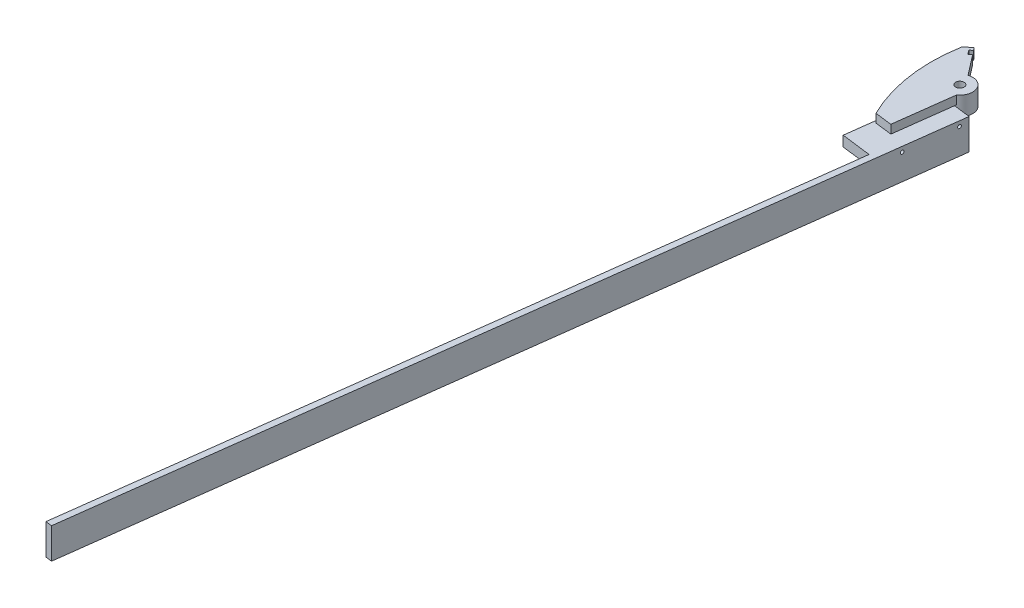
ISO-10303-21;
HEADER;
FILE_DESCRIPTION(('STEP AP214'),'2;1');
FILE_NAME('part.step','',(''),(''),'','','');
FILE_SCHEMA(('AUTOMOTIVE_DESIGN { 1 0 10303 214 1 1 1 1 }'));
ENDSEC;
DATA;
#1=APPLICATION_CONTEXT('core data for automotive mechanical design processes');
#2=APPLICATION_PROTOCOL_DEFINITION('international standard','automotive_design',2000,#1);
#3=PRODUCT_CONTEXT('',#1,'mechanical');
#4=PRODUCT('Part','Part','',(#3));
#5=PRODUCT_RELATED_PRODUCT_CATEGORY('part','',(#4));
#6=PRODUCT_DEFINITION_FORMATION('','',#4);
#7=PRODUCT_DEFINITION_CONTEXT('part definition',#1,'design');
#8=PRODUCT_DEFINITION('design','',#6,#7);
#9=PRODUCT_DEFINITION_SHAPE('','',#8);
#10=(LENGTH_UNIT() NAMED_UNIT(*) SI_UNIT(.MILLI.,.METRE.));
#11=(NAMED_UNIT(*) PLANE_ANGLE_UNIT() SI_UNIT($,.RADIAN.));
#12=(NAMED_UNIT(*) SI_UNIT($,.STERADIAN.) SOLID_ANGLE_UNIT());
#13=UNCERTAINTY_MEASURE_WITH_UNIT(LENGTH_MEASURE(1.E-05),#10,'distance_accuracy_value','');
#14=(GEOMETRIC_REPRESENTATION_CONTEXT(3) GLOBAL_UNCERTAINTY_ASSIGNED_CONTEXT((#13)) GLOBAL_UNIT_ASSIGNED_CONTEXT((#10,
#11,#12)) REPRESENTATION_CONTEXT('',''));
#15=CARTESIAN_POINT('',(0.,0.,0.));
#16=DIRECTION('',(0.,0.,1.));
#17=DIRECTION('',(1.,0.,0.));
#18=AXIS2_PLACEMENT_3D('',#15,#16,#17);
#19=CARTESIAN_POINT('',(-9.53420715241662,21.0997300772886,119.130224561307));
#20=DIRECTION('',(0.,-1.,0.));
#21=DIRECTION('',(-0.127290481997306,0.,0.99186548140002));
#22=AXIS2_PLACEMENT_3D('',#19,#20,#21);
#23=PLANE('',#22);
#24=DIRECTION('',(-0.127290481997306,0.,0.99186548140002));
#25=VECTOR('',#24,1.);
#26=CARTESIAN_POINT('',(-6.38503424897156,21.0997300772886,119.534371841648));
#27=LINE('',#26,#25);
#28=CARTESIAN_POINT('',(-6.83688464485413,21.0997300772886,123.05525418415));
#29=VERTEX_POINT('',#28);
#30=CARTESIAN_POINT('',(-6.91967084738493,21.0997300772886,123.700336010679));
#31=VERTEX_POINT('',#30);
#32=EDGE_CURVE('E270',#29,#31,#27,.T.);
#33=ORIENTED_EDGE('',*,*,#32,.T.);
#34=DIRECTION('',(-0.99186548140002,0.,-0.127290481997306));
#35=VECTOR('',#34,1.);
#36=CARTESIAN_POINT('',(-0.756403202923642,21.0997300772886,124.491295393633));
#37=LINE('',#36,#35);
#38=CARTESIAN_POINT('',(-7.84204223567497,21.0997300772886,123.581964012864));
#39=VERTEX_POINT('',#38);
#40=EDGE_CURVE('E11',#31,#39,#37,.T.);
#41=ORIENTED_EDGE('',*,*,#40,.T.);
#42=CARTESIAN_POINT('',(-9.53420715241662,21.0997300772886,119.130224561307));
#43=DIRECTION('',(0.,-1.,0.));
#44=DIRECTION('',(-0.127290481997306,0.,0.99186548140002));
#45=AXIS2_PLACEMENT_3D('',#42,#43,#44);
#46=CIRCLE('',#45,4.7625);
#47=EDGE_CURVE('E54',#29,#39,#46,.T.);
#48=ORIENTED_EDGE('',*,*,#47,.F.);
#49=EDGE_LOOP('',(#33,#41,#48));
#50=FACE_BOUND('',#49,.T.);
#51=ADVANCED_FACE('F44',(#50),#23,.T.);
#52=CARTESIAN_POINT('',(-12.7673853951482,21.0997300772886,144.323607788868));
#53=DIRECTION('',(-0.127290481997306,0.,0.99186548140002));
#54=DIRECTION('',(-0.99186548140002,0.,-0.127290481997306));
#55=AXIS2_PLACEMENT_3D('',#52,#53,#54);
#56=PLANE('',#55);
#57=DIRECTION('',(0.99186548140002,0.,0.127290481997306));
#58=VECTOR('',#57,1.);
#59=CARTESIAN_POINT('',(-12.7673853951482,24.2747300772886,144.323607788868));
#60=LINE('',#59,#58);
#61=CARTESIAN_POINT('',(-15.9165582985933,24.2747300772886,143.919460508526));
#62=VERTEX_POINT('',#61);
#63=CARTESIAN_POINT('',(-9.61821249170314,24.2747300772886,144.727755069209));
#64=VERTEX_POINT('',#63);
#65=EDGE_CURVE('E238',#62,#64,#60,.T.);
#66=ORIENTED_EDGE('',*,*,#65,.F.);
#67=DIRECTION('',(0.,1.,0.));
#68=VECTOR('',#67,1.);
#69=CARTESIAN_POINT('',(-15.9165582985933,21.0997300772886,143.919460508526));
#70=LINE('',#69,#68);
#71=CARTESIAN_POINT('',(-15.9165582985933,21.0997300772886,143.919460508526));
#72=VERTEX_POINT('',#71);
#73=EDGE_CURVE('E48',#72,#62,#70,.T.);
#74=ORIENTED_EDGE('',*,*,#73,.F.);
#75=DIRECTION('',(0.99186548140002,0.,0.127290481997306));
#76=VECTOR('',#75,1.);
#77=CARTESIAN_POINT('',(-12.7673853951482,21.0997300772886,144.323607788868));
#78=LINE('',#77,#76);
#79=CARTESIAN_POINT('',(-9.61821249170314,21.0997300772886,144.727755069209));
#80=VERTEX_POINT('',#79);
#81=EDGE_CURVE('E239',#72,#80,#78,.T.);
#82=ORIENTED_EDGE('',*,*,#81,.T.);
#83=DIRECTION('',(0.,1.,0.));
#84=VECTOR('',#83,1.);
#85=CARTESIAN_POINT('',(-9.61821249170314,21.0997300772886,144.727755069209));
#86=LINE('',#85,#84);
#87=EDGE_CURVE('E273',#80,#64,#86,.T.);
#88=ORIENTED_EDGE('',*,*,#87,.T.);
#89=EDGE_LOOP('',(#66,#74,#82,#88));
#90=FACE_BOUND('',#89,.T.);
#91=ADVANCED_FACE('F46',(#90),#56,.T.);
#92=CARTESIAN_POINT('',(38.0750915800716,21.0997300772886,117.05461734119));
#93=DIRECTION('',(0.,1.,0.));
#94=DIRECTION('',(0.127290481997306,0.,-0.99186548140002));
#95=AXIS2_PLACEMENT_3D('',#92,#93,#94);
#96=CYLINDRICAL_SURFACE('',#95,60.3060366383488);
#97=CARTESIAN_POINT('',(38.0750915800716,24.2747300772886,117.05461734119));
#98=DIRECTION('',(0.,-1.,0.));
#99=DIRECTION('',(-0.127290481997306,0.,0.99186548140002));
#100=AXIS2_PLACEMENT_3D('',#97,#98,#99);
#101=CIRCLE('',#100,60.3060366383488);
#102=CARTESIAN_POINT('',(-21.2996261048711,24.2747300772886,106.497110303104));
#103=VERTEX_POINT('',#102);
#104=EDGE_CURVE('E277',#103,#62,#101,.F.);
#105=ORIENTED_EDGE('',*,*,#104,.F.);
#106=DIRECTION('',(0.,1.,0.));
#107=VECTOR('',#106,1.);
#108=CARTESIAN_POINT('',(-21.2996261048711,21.0997300772886,106.497110303104));
#109=LINE('',#108,#107);
#110=CARTESIAN_POINT('',(-21.2996261048711,21.0997300772886,106.497110303104));
#111=VERTEX_POINT('',#110);
#112=EDGE_CURVE('E338',#111,#103,#109,.T.);
#113=ORIENTED_EDGE('',*,*,#112,.F.);
#114=CARTESIAN_POINT('',(38.0750915800716,21.0997300772886,117.05461734119));
#115=DIRECTION('',(0.,-1.,0.));
#116=DIRECTION('',(-0.127290481997306,0.,0.99186548140002));
#117=AXIS2_PLACEMENT_3D('',#114,#115,#116);
#118=CIRCLE('',#117,60.3060366383488);
#119=CARTESIAN_POINT('',(-16.6563367153482,21.0997300772886,142.378298190727));
#120=VERTEX_POINT('',#119);
#121=EDGE_CURVE('E245',#111,#120,#118,.F.);
#122=ORIENTED_EDGE('',*,*,#121,.T.);
#123=EDGE_CURVE('E243',#120,#72,#118,.F.);
#124=ORIENTED_EDGE('',*,*,#123,.T.);
#125=ORIENTED_EDGE('',*,*,#73,.T.);
#126=EDGE_LOOP('',(#105,#113,#122,#124,#125));
#127=FACE_BOUND('',#126,.T.);
#128=ADVANCED_FACE('F475',(#127),#96,.T.);
#129=CARTESIAN_POINT('',(-20.0433377060299,21.0997300772886,105.526597186791));
#130=DIRECTION('',(-0.611346844922019,0.,-0.79136277092361));
#131=DIRECTION('',(0.79136277092361,0.,-0.611346844922019));
#132=AXIS2_PLACEMENT_3D('',#129,#130,#131);
#133=PLANE('',#132);
#134=DIRECTION('',(-0.79136277092361,0.,0.611346844922019));
#135=VECTOR('',#134,1.);
#136=CARTESIAN_POINT('',(-20.0433377060299,24.2747300772886,105.526597186791));
#137=LINE('',#136,#135);
#138=CARTESIAN_POINT('',(-18.7870493071886,24.2747300772886,104.556084070477));
#139=VERTEX_POINT('',#138);
#140=EDGE_CURVE('E281',#139,#103,#137,.T.);
#141=ORIENTED_EDGE('',*,*,#140,.F.);
#142=DIRECTION('',(0.,1.,0.));
#143=VECTOR('',#142,1.);
#144=CARTESIAN_POINT('',(-18.7870493071886,21.0997300772886,104.556084070477));
#145=LINE('',#144,#143);
#146=CARTESIAN_POINT('',(-18.7870493071886,21.0997300772886,104.556084070477));
#147=VERTEX_POINT('',#146);
#148=EDGE_CURVE('E336',#147,#139,#145,.T.);
#149=ORIENTED_EDGE('',*,*,#148,.F.);
#150=DIRECTION('',(-0.79136277092361,0.,0.611346844922019));
#151=VECTOR('',#150,1.);
#152=CARTESIAN_POINT('',(-20.0433377060299,21.0997300772886,105.526597186791));
#153=LINE('',#152,#151);
#154=EDGE_CURVE('E249',#147,#111,#153,.T.);
#155=ORIENTED_EDGE('',*,*,#154,.T.);
#156=ORIENTED_EDGE('',*,*,#112,.T.);
#157=EDGE_LOOP('',(#141,#149,#155,#156));
#158=FACE_BOUND('',#157,.T.);
#159=ADVANCED_FACE('F505',(#158),#133,.T.);
#160=CARTESIAN_POINT('',(-8.27791875357566,21.0997300772886,118.159711444994));
#161=DIRECTION('',(0.791362770923625,0.,-0.611346844921998));
#162=DIRECTION('',(0.611346844921998,0.,0.791362770923626));
#163=AXIS2_PLACEMENT_3D('',#160,#161,#162);
#164=PLANE('',#163);
#165=DIRECTION('',(-0.611346844921998,0.,-0.791362770923626));
#166=VECTOR('',#165,1.);
#167=CARTESIAN_POINT('',(-8.27791875357566,24.2747300772886,118.159711444994));
#168=LINE('',#167,#166);
#169=CARTESIAN_POINT('',(-18.0106388141377,24.2747300772886,105.56111478955));
#170=VERTEX_POINT('',#169);
#171=EDGE_CURVE('E285',#170,#139,#168,.T.);
#172=ORIENTED_EDGE('',*,*,#171,.F.);
#173=DIRECTION('',(0.,1.,0.));
#174=VECTOR('',#173,1.);
#175=CARTESIAN_POINT('',(-18.0106388141377,21.0997300772886,105.56111478955));
#176=LINE('',#175,#174);
#177=CARTESIAN_POINT('',(-18.0106388141377,21.0997300772886,105.56111478955));
#178=VERTEX_POINT('',#177);
#179=EDGE_CURVE('E333',#178,#170,#176,.T.);
#180=ORIENTED_EDGE('',*,*,#179,.F.);
#181=DIRECTION('',(-0.611346844921998,0.,-0.791362770923626));
#182=VECTOR('',#181,1.);
#183=CARTESIAN_POINT('',(-8.27791875357566,21.0997300772886,118.159711444994));
#184=LINE('',#183,#182);
#185=EDGE_CURVE('E253',#178,#147,#184,.T.);
#186=ORIENTED_EDGE('',*,*,#185,.T.);
#187=ORIENTED_EDGE('',*,*,#148,.T.);
#188=EDGE_LOOP('',(#172,#180,#186,#187));
#189=FACE_BOUND('',#188,.T.);
#190=ADVANCED_FACE('F508',(#189),#164,.T.);
#191=CARTESIAN_POINT('',(-19.2669272129789,21.0997300772886,106.531627905864));
#192=DIRECTION('',(-0.61134684492202,0.,-0.791362770923609));
#193=DIRECTION('',(0.791362770923609,0.,-0.61134684492202));
#194=AXIS2_PLACEMENT_3D('',#191,#192,#193);
#195=PLANE('',#194);
#196=DIRECTION('',(-0.791362770923609,0.,0.61134684492202));
#197=VECTOR('',#196,1.);
#198=CARTESIAN_POINT('',(-19.2669272129789,24.2747300772886,106.531627905864));
#199=LINE('',#198,#197);
#200=CARTESIAN_POINT('',(-19.0156695332106,24.2747300772886,106.337525282601));
#201=VERTEX_POINT('',#200);
#202=EDGE_CURVE('E289',#170,#201,#199,.T.);
#203=ORIENTED_EDGE('',*,*,#202,.T.);
#204=DIRECTION('',(0.,1.,0.));
#205=VECTOR('',#204,1.);
#206=CARTESIAN_POINT('',(-19.0156695332106,21.0997300772886,106.337525282601));
#207=LINE('',#206,#205);
#208=CARTESIAN_POINT('',(-19.0156695332106,21.0997300772886,106.337525282601));
#209=VERTEX_POINT('',#208);
#210=EDGE_CURVE('E329',#209,#201,#207,.T.);
#211=ORIENTED_EDGE('',*,*,#210,.F.);
#212=DIRECTION('',(-0.791362770923609,0.,0.61134684492202));
#213=VECTOR('',#212,1.);
#214=CARTESIAN_POINT('',(-19.2669272129789,21.0997300772886,106.531627905864));
#215=LINE('',#214,#213);
#216=EDGE_CURVE('E257',#178,#209,#215,.T.);
#217=ORIENTED_EDGE('',*,*,#216,.F.);
#218=ORIENTED_EDGE('',*,*,#179,.T.);
#219=EDGE_LOOP('',(#203,#211,#217,#218));
#220=FACE_BOUND('',#219,.T.);
#221=ADVANCED_FACE('F514',(#220),#195,.F.);
#222=CARTESIAN_POINT('',(-9.28294947264835,21.0997300772886,118.936121938044));
#223=DIRECTION('',(-0.79136277092361,0.,0.611346844922019));
#224=DIRECTION('',(-0.611346844922019,0.,-0.79136277092361));
#225=AXIS2_PLACEMENT_3D('',#222,#223,#224);
#226=PLANE('',#225);
#227=DIRECTION('',(0.611346844922019,0.,0.79136277092361));
#228=VECTOR('',#227,1.);
#229=CARTESIAN_POINT('',(-9.28294947264835,24.2747300772886,118.936121938044));
#230=LINE('',#229,#228);
#231=CARTESIAN_POINT('',(-17.8510537936342,24.2747300772886,107.84507136121));
#232=VERTEX_POINT('',#231);
#233=EDGE_CURVE('E292',#201,#232,#230,.T.);
#234=ORIENTED_EDGE('',*,*,#233,.T.);
#235=DIRECTION('',(0.,1.,0.));
#236=VECTOR('',#235,1.);
#237=CARTESIAN_POINT('',(-17.8510537936342,21.0997300772886,107.84507136121));
#238=LINE('',#237,#236);
#239=CARTESIAN_POINT('',(-17.8510537936342,21.0997300772886,107.84507136121));
#240=VERTEX_POINT('',#239);
#241=EDGE_CURVE('E325',#240,#232,#238,.T.);
#242=ORIENTED_EDGE('',*,*,#241,.F.);
#243=DIRECTION('',(0.611346844922019,0.,0.79136277092361));
#244=VECTOR('',#243,1.);
#245=CARTESIAN_POINT('',(-9.28294947264835,21.0997300772886,118.936121938044));
#246=LINE('',#245,#244);
#247=EDGE_CURVE('E260',#209,#240,#246,.T.);
#248=ORIENTED_EDGE('',*,*,#247,.F.);
#249=ORIENTED_EDGE('',*,*,#210,.T.);
#250=EDGE_LOOP('',(#234,#242,#248,#249));
#251=FACE_BOUND('',#250,.T.);
#252=ADVANCED_FACE('F518',(#251),#226,.F.);
#253=CARTESIAN_POINT('',(-18.1023114734025,21.0997300772886,108.039173984473));
#254=DIRECTION('',(0.611346844922019,0.,0.79136277092361));
#255=DIRECTION('',(-0.79136277092361,0.,0.611346844922019));
#256=AXIS2_PLACEMENT_3D('',#253,#254,#255);
#257=PLANE('',#256);
#258=DIRECTION('',(0.79136277092361,0.,-0.611346844922019));
#259=VECTOR('',#258,1.);
#260=CARTESIAN_POINT('',(-18.1023114734025,24.2747300772886,108.039173984473));
#261=LINE('',#260,#259);
#262=CARTESIAN_POINT('',(-16.8460230745612,24.2747300772886,107.068660868159));
#263=VERTEX_POINT('',#262);
#264=EDGE_CURVE('E295',#232,#263,#261,.T.);
#265=ORIENTED_EDGE('',*,*,#264,.T.);
#266=DIRECTION('',(0.,1.,0.));
#267=VECTOR('',#266,1.);
#268=CARTESIAN_POINT('',(-16.8460230745612,21.0997300772886,107.068660868159));
#269=LINE('',#268,#267);
#270=CARTESIAN_POINT('',(-16.8460230745612,21.0997300772886,107.068660868159));
#271=VERTEX_POINT('',#270);
#272=EDGE_CURVE('E322',#271,#263,#269,.T.);
#273=ORIENTED_EDGE('',*,*,#272,.F.);
#274=DIRECTION('',(0.79136277092361,0.,-0.611346844922019));
#275=VECTOR('',#274,1.);
#276=CARTESIAN_POINT('',(-18.1023114734025,21.0997300772886,108.039173984473));
#277=LINE('',#276,#275);
#278=EDGE_CURVE('E263',#240,#271,#277,.T.);
#279=ORIENTED_EDGE('',*,*,#278,.F.);
#280=ORIENTED_EDGE('',*,*,#241,.T.);
#281=EDGE_LOOP('',(#265,#273,#279,#280));
#282=FACE_BOUND('',#281,.T.);
#283=ADVANCED_FACE('F523',(#282),#257,.F.);
#284=CARTESIAN_POINT('',(-8.27791875357533,21.0997300772886,118.159711444993));
#285=DIRECTION('',(0.791362770923608,0.,-0.611346844922021));
#286=DIRECTION('',(0.611346844922021,0.,0.791362770923608));
#287=AXIS2_PLACEMENT_3D('',#284,#285,#286);
#288=PLANE('',#287);
#289=DIRECTION('',(-0.611346844922021,0.,-0.791362770923608));
#290=VECTOR('',#289,1.);
#291=CARTESIAN_POINT('',(-8.27791875357533,24.2747300772886,118.159711444993));
#292=LINE('',#291,#290);
#293=CARTESIAN_POINT('',(-11.022944376679,24.2747300772886,114.606391261207));
#294=VERTEX_POINT('',#293);
#295=EDGE_CURVE('E299',#294,#263,#292,.T.);
#296=ORIENTED_EDGE('',*,*,#295,.F.);
#297=DIRECTION('',(0.,1.,0.));
#298=VECTOR('',#297,1.);
#299=CARTESIAN_POINT('',(-11.022944376679,21.0997300772886,114.606391261207));
#300=LINE('',#299,#298);
#301=CARTESIAN_POINT('',(-11.022944376679,21.0997300772886,114.606391261207));
#302=VERTEX_POINT('',#301);
#303=EDGE_CURVE('E319',#302,#294,#300,.T.);
#304=ORIENTED_EDGE('',*,*,#303,.F.);
#305=DIRECTION('',(-0.611346844922021,0.,-0.791362770923608));
#306=VECTOR('',#305,1.);
#307=CARTESIAN_POINT('',(-8.27791875357533,21.0997300772886,118.159711444993));
#308=LINE('',#307,#306);
#309=EDGE_CURVE('E266',#302,#271,#308,.T.);
#310=ORIENTED_EDGE('',*,*,#309,.T.);
#311=ORIENTED_EDGE('',*,*,#272,.T.);
#312=EDGE_LOOP('',(#296,#304,#310,#311));
#313=FACE_BOUND('',#312,.T.);
#314=ADVANCED_FACE('F525',(#313),#288,.T.);
#315=CARTESIAN_POINT('',(-9.53420715241662,21.0997300772886,119.130224561307));
#316=DIRECTION('',(0.,1.,0.));
#317=DIRECTION('',(0.127290481997306,0.,-0.99186548140002));
#318=AXIS2_PLACEMENT_3D('',#315,#316,#317);
#319=CYLINDRICAL_SURFACE('',#318,4.7625);
#320=CARTESIAN_POINT('',(-9.53420715241662,24.2747300772886,119.130224561307));
#321=DIRECTION('',(0.,-1.,0.));
#322=DIRECTION('',(-0.127290481997306,0.,0.99186548140002));
#323=AXIS2_PLACEMENT_3D('',#320,#321,#322);
#324=CIRCLE('',#323,4.7625);
#325=CARTESIAN_POINT('',(-6.83688464485413,24.2747300772886,123.05525418415));
#326=VERTEX_POINT('',#325);
#327=EDGE_CURVE('E303',#294,#326,#324,.T.);
#328=ORIENTED_EDGE('',*,*,#327,.T.);
#329=DIRECTION('',(0.,1.,0.));
#330=VECTOR('',#329,1.);
#331=CARTESIAN_POINT('',(-6.83688464485413,21.0997300772886,123.05525418415));
#332=LINE('',#331,#330);
#333=EDGE_CURVE('E315',#29,#326,#332,.T.);
#334=ORIENTED_EDGE('',*,*,#333,.F.);
#335=ORIENTED_EDGE('',*,*,#47,.T.);
#336=DIRECTION('',(0.,1.,0.));
#337=VECTOR('',#336,1.);
#338=CARTESIAN_POINT('',(-7.84204223567497,17.2897300772886,123.581964012864));
#339=LINE('',#338,#337);
#340=CARTESIAN_POINT('',(-7.84204223567497,17.2897300772886,123.581964012864));
#341=VERTEX_POINT('',#340);
#342=EDGE_CURVE('E388',#341,#39,#339,.T.);
#343=ORIENTED_EDGE('',*,*,#342,.F.);
#344=CARTESIAN_POINT('',(-9.53420715241662,17.2897300772886,119.130224561307));
#345=DIRECTION('',(0.,-1.,0.));
#346=DIRECTION('',(-0.127290481997306,0.,0.99186548140002));
#347=AXIS2_PLACEMENT_3D('',#344,#345,#346);
#348=CIRCLE('',#347,4.7625);
#349=CARTESIAN_POINT('',(-13.9131232197309,17.2897300772886,121.002789733849));
#350=VERTEX_POINT('',#349);
#351=EDGE_CURVE('E377',#350,#341,#348,.T.);
#352=ORIENTED_EDGE('',*,*,#351,.F.);
#353=DIRECTION('',(0.,1.,0.));
#354=VECTOR('',#353,1.);
#355=CARTESIAN_POINT('',(-13.9131232197309,17.2897300772886,121.002789733849));
#356=LINE('',#355,#354);
#357=CARTESIAN_POINT('',(-13.9131232197309,21.0997300772886,121.002789733849));
#358=VERTEX_POINT('',#357);
#359=EDGE_CURVE('E393',#350,#358,#356,.T.);
#360=ORIENTED_EDGE('',*,*,#359,.T.);
#361=EDGE_CURVE('E192',#358,#302,#46,.T.);
#362=ORIENTED_EDGE('',*,*,#361,.T.);
#363=ORIENTED_EDGE('',*,*,#303,.T.);
#364=EDGE_LOOP('',(#328,#334,#335,#343,#352,#360,#362,#363));
#365=FACE_BOUND('',#364,.T.);
#366=ADVANCED_FACE('F492',(#365),#319,.T.);
#367=CARTESIAN_POINT('',(-6.38503424897156,21.0997300772886,119.534371841648));
#368=DIRECTION('',(-0.99186548140002,0.,-0.127290481997306));
#369=DIRECTION('',(0.127290481997306,0.,-0.99186548140002));
#370=AXIS2_PLACEMENT_3D('',#367,#368,#369);
#371=PLANE('',#370);
#372=DIRECTION('',(-0.127290481997306,0.,0.99186548140002));
#373=VECTOR('',#372,1.);
#374=CARTESIAN_POINT('',(-6.38503424897156,24.2747300772886,119.534371841648));
#375=LINE('',#374,#373);
#376=EDGE_CURVE('E306',#326,#64,#375,.T.);
#377=ORIENTED_EDGE('',*,*,#376,.T.);
#378=ORIENTED_EDGE('',*,*,#87,.F.);
#379=EDGE_CURVE('E69',#31,#80,#27,.T.);
#380=ORIENTED_EDGE('',*,*,#379,.F.);
#381=ORIENTED_EDGE('',*,*,#32,.F.);
#382=ORIENTED_EDGE('',*,*,#333,.T.);
#383=EDGE_LOOP('',(#377,#378,#380,#381,#382));
#384=FACE_BOUND('',#383,.T.);
#385=ADVANCED_FACE('F486',(#384),#371,.F.);
#386=CARTESIAN_POINT('',(-9.53420715241662,21.0997300772886,119.130224561307));
#387=DIRECTION('',(0.,1.,0.));
#388=DIRECTION('',(0.127290481997306,0.,-0.99186548140002));
#389=AXIS2_PLACEMENT_3D('',#386,#387,#388);
#390=CYLINDRICAL_SURFACE('',#389,1.5875);
#391=CARTESIAN_POINT('',(-9.53420715241662,24.2747300772886,119.130224561307));
#392=DIRECTION('',(0.,-1.,0.));
#393=DIRECTION('',(-0.127290481997306,0.,0.99186548140002));
#394=AXIS2_PLACEMENT_3D('',#391,#392,#393);
#395=CIRCLE('',#394,1.5875);
#396=CARTESIAN_POINT('',(-9.73628079258734,24.2747300772886,120.70481101303));
#397=VERTEX_POINT('',#396);
#398=EDGE_CURVE('E244',#397,#397,#395,.T.);
#399=ORIENTED_EDGE('',*,*,#398,.F.);
#400=EDGE_LOOP('',(#399));
#401=FACE_BOUND('',#400,.T.);
#402=CARTESIAN_POINT('',(-9.53420715241662,17.2897300772886,119.130224561307));
#403=DIRECTION('',(0.,-1.,0.));
#404=DIRECTION('',(-0.127290481997306,0.,0.99186548140002));
#405=AXIS2_PLACEMENT_3D('',#402,#403,#404);
#406=CIRCLE('',#405,1.5875);
#407=CARTESIAN_POINT('',(-9.73628079258734,17.2897300772886,120.70481101303));
#408=VERTEX_POINT('',#407);
#409=EDGE_CURVE('E381',#408,#408,#406,.T.);
#410=ORIENTED_EDGE('',*,*,#409,.T.);
#411=EDGE_LOOP('',(#410));
#412=FACE_BOUND('',#411,.T.);
#413=ADVANCED_FACE('F479',(#401,#412),#390,.F.);
#414=ORIENTED_EDGE('',*,*,#361,.F.);
#415=DIRECTION('',(0.127290481997306,0.,-0.99186548140002));
#416=VECTOR('',#415,1.);
#417=CARTESIAN_POINT('',(-13.6057514441518,21.0997300772886,118.607705283152));
#418=LINE('',#417,#416);
#419=EDGE_CURVE('E344',#120,#358,#418,.T.);
#420=ORIENTED_EDGE('',*,*,#419,.F.);
#421=ORIENTED_EDGE('',*,*,#121,.F.);
#422=ORIENTED_EDGE('',*,*,#154,.F.);
#423=ORIENTED_EDGE('',*,*,#185,.F.);
#424=ORIENTED_EDGE('',*,*,#216,.T.);
#425=ORIENTED_EDGE('',*,*,#247,.T.);
#426=ORIENTED_EDGE('',*,*,#278,.T.);
#427=ORIENTED_EDGE('',*,*,#309,.F.);
#428=EDGE_LOOP('',(#414,#420,#421,#422,#423,#424,#425,#426,#427));
#429=FACE_BOUND('',#428,.T.);
#430=ADVANCED_FACE('F471',(#429),#23,.T.);
#431=CARTESIAN_POINT('',(-9.53420715241662,24.2747300772886,119.130224561307));
#432=DIRECTION('',(0.,-1.,0.));
#433=DIRECTION('',(-0.127290481997306,0.,0.99186548140002));
#434=AXIS2_PLACEMENT_3D('',#431,#432,#433);
#435=PLANE('',#434);
#436=ORIENTED_EDGE('',*,*,#65,.T.);
#437=ORIENTED_EDGE('',*,*,#376,.F.);
#438=ORIENTED_EDGE('',*,*,#327,.F.);
#439=ORIENTED_EDGE('',*,*,#295,.T.);
#440=ORIENTED_EDGE('',*,*,#264,.F.);
#441=ORIENTED_EDGE('',*,*,#233,.F.);
#442=ORIENTED_EDGE('',*,*,#202,.F.);
#443=ORIENTED_EDGE('',*,*,#171,.T.);
#444=ORIENTED_EDGE('',*,*,#140,.T.);
#445=ORIENTED_EDGE('',*,*,#104,.T.);
#446=EDGE_LOOP('',(#436,#437,#438,#439,#440,#441,#442,#443,#444,#445));
#447=FACE_BOUND('',#446,.T.);
#448=ORIENTED_EDGE('',*,*,#398,.T.);
#449=EDGE_LOOP('',(#448));
#450=FACE_BOUND('',#449,.T.);
#451=ADVANCED_FACE('F468',(#447,#450),#435,.F.);
#452=CARTESIAN_POINT('',(-22.5173523368969,15.3847300772886,275.34848429874));
#453=DIRECTION('',(-0.99186548140002,0.,-0.127290481997306));
#454=DIRECTION('',(-0.127290481997306,0.,0.99186548140002));
#455=AXIS2_PLACEMENT_3D('',#452,#453,#454);
#456=PLANE('',#455);
#457=DIRECTION('',(-0.127290481997306,0.,0.99186548140002));
#458=VECTOR('',#457,1.);
#459=CARTESIAN_POINT('',(-41.9164217932864,21.0997300772886,426.508783664103));
#460=LINE('',#459,#458);
#461=CARTESIAN_POINT('',(-7.11296800820683,21.0997300772886,155.315337765675));
#462=VERTEX_POINT('',#461);
#463=CARTESIAN_POINT('',(-41.9164217932864,21.0997300772886,426.508783664103));
#464=VERTEX_POINT('',#463);
#465=EDGE_CURVE('E183',#462,#464,#460,.T.);
#466=ORIENTED_EDGE('',*,*,#465,.F.);
#467=DIRECTION('',(0.,-1.,0.));
#468=VECTOR('',#467,1.);
#469=CARTESIAN_POINT('',(-7.11296800820683,21.0997300772886,155.315337765675));
#470=LINE('',#469,#468);
#471=CARTESIAN_POINT('',(-7.11296800820683,17.2897300772886,155.315337765675));
#472=VERTEX_POINT('',#471);
#473=EDGE_CURVE('E195',#462,#472,#470,.T.);
#474=ORIENTED_EDGE('',*,*,#473,.T.);
#475=DIRECTION('',(0.127290481997306,0.,-0.99186548140002));
#476=VECTOR('',#475,1.);
#477=CARTESIAN_POINT('',(-7.11296800820683,17.2897300772886,155.315337765675));
#478=LINE('',#477,#476);
#479=CARTESIAN_POINT('',(-3.11828288050744,17.2897300772886,124.188184933377));
#480=VERTEX_POINT('',#479);
#481=EDGE_CURVE('E202',#472,#480,#478,.T.);
#482=ORIENTED_EDGE('',*,*,#481,.T.);
#483=DIRECTION('',(0.,1.,0.));
#484=VECTOR('',#483,1.);
#485=CARTESIAN_POINT('',(-3.11828288050744,9.66973007728863,124.188184933377));
#486=LINE('',#485,#484);
#487=CARTESIAN_POINT('',(-3.11828288050744,9.66973007728863,124.188184933377));
#488=VERTEX_POINT('',#487);
#489=EDGE_CURVE('E210',#488,#480,#486,.T.);
#490=ORIENTED_EDGE('',*,*,#489,.F.);
#491=DIRECTION('',(0.127290481997306,0.,-0.99186548140002));
#492=VECTOR('',#491,1.);
#493=CARTESIAN_POINT('',(-41.9164217932864,9.66973007728861,426.508783664103));
#494=LINE('',#493,#492);
#495=CARTESIAN_POINT('',(-41.9164217932864,9.66973007728861,426.508783664103));
#496=VERTEX_POINT('',#495);
#497=EDGE_CURVE('E214',#496,#488,#494,.T.);
#498=ORIENTED_EDGE('',*,*,#497,.F.);
#499=DIRECTION('',(0.,-1.,0.));
#500=VECTOR('',#499,1.);
#501=CARTESIAN_POINT('',(-41.9164217932864,9.66973007728861,426.508783664103));
#502=LINE('',#501,#500);
#503=EDGE_CURVE('E208',#464,#496,#502,.T.);
#504=ORIENTED_EDGE('',*,*,#503,.F.);
#505=EDGE_LOOP('',(#466,#474,#482,#490,#498,#504));
#506=FACE_BOUND('',#505,.T.);
#507=ADVANCED_FACE('F206',(#506),#456,.T.);
#508=CARTESIAN_POINT('',(-5.94731384289757,19.1947300772886,146.232395257492));
#509=DIRECTION('',(0.99186548140002,0.,0.127290481997306));
#510=DIRECTION('',(0.127290481997306,0.,-0.99186548140002));
#511=AXIS2_PLACEMENT_3D('',#508,#509,#510);
#512=CIRCLE('',#511,0.634999999999989);
#513=CARTESIAN_POINT('',(-5.86648438682928,19.1947300772886,145.602560676803));
#514=VERTEX_POINT('',#513);
#515=EDGE_CURVE('E217',#514,#514,#512,.T.);
#516=ORIENTED_EDGE('',*,*,#515,.T.);
#517=EDGE_LOOP('',(#516));
#518=FACE_BOUND('',#517,.T.);
#519=CARTESIAN_POINT('',(-5.94731384289751,19.1947300772886,146.232395257492));
#520=DIRECTION('',(0.99186548140002,0.,0.127290481997306));
#521=DIRECTION('',(-0.127290481997306,0.,0.99186548140002));
#522=AXIS2_PLACEMENT_3D('',#519,#520,#521);
#523=CIRCLE('',#522,1.27);
#524=CARTESIAN_POINT('',(-6.10897275503409,19.1947300772886,147.49206441887));
#525=VERTEX_POINT('',#524);
#526=EDGE_CURVE('E203',#525,#525,#523,.T.);
#527=ORIENTED_EDGE('',*,*,#526,.F.);
#528=EDGE_LOOP('',(#527));
#529=FACE_BOUND('',#528,.T.);
#530=ADVANCED_FACE('F456',(#518,#529),#456,.T.);
#531=CARTESIAN_POINT('',(-3.52243016084889,19.1947300772886,127.337357836822));
#532=DIRECTION('',(0.99186548140002,0.,0.127290481997306));
#533=DIRECTION('',(0.127290481997306,0.,-0.99186548140002));
#534=AXIS2_PLACEMENT_3D('',#531,#532,#533);
#535=CIRCLE('',#534,0.634999999999989);
#536=CARTESIAN_POINT('',(-3.4416007047806,19.1947300772886,126.707523256133));
#537=VERTEX_POINT('',#536);
#538=EDGE_CURVE('E398',#537,#537,#535,.T.);
#539=ORIENTED_EDGE('',*,*,#538,.T.);
#540=EDGE_LOOP('',(#539));
#541=FACE_BOUND('',#540,.T.);
#542=CARTESIAN_POINT('',(-3.52243016084882,19.1947300772886,127.337357836821));
#543=DIRECTION('',(0.99186548140002,0.,0.127290481997306));
#544=DIRECTION('',(-0.127290481997306,0.,0.99186548140002));
#545=AXIS2_PLACEMENT_3D('',#542,#543,#544);
#546=CIRCLE('',#545,1.27);
#547=CARTESIAN_POINT('',(-3.6840890729854,19.1947300772886,128.597026998199));
#548=VERTEX_POINT('',#547);
#549=EDGE_CURVE('E447',#548,#548,#546,.T.);
#550=ORIENTED_EDGE('',*,*,#549,.F.);
#551=EDGE_LOOP('',(#550));
#552=FACE_BOUND('',#551,.T.);
#553=ADVANCED_FACE('F454',(#541,#552),#456,.T.);
#554=CARTESIAN_POINT('',(-0.756403202923642,9.66973007728863,124.491295393633));
#555=DIRECTION('',(-0.127290481997306,0.,0.99186548140002));
#556=DIRECTION('',(0.99186548140002,0.,0.127290481997306));
#557=AXIS2_PLACEMENT_3D('',#554,#555,#556);
#558=PLANE('',#557);
#559=ORIENTED_EDGE('',*,*,#489,.T.);
#560=DIRECTION('',(-0.99186548140002,0.,-0.127290481997306));
#561=VECTOR('',#560,1.);
#562=CARTESIAN_POINT('',(-3.11828288050737,17.2897300772886,124.188184933376));
#563=LINE('',#562,#561);
#564=EDGE_CURVE('E369',#480,#341,#563,.T.);
#565=ORIENTED_EDGE('',*,*,#564,.T.);
#566=ORIENTED_EDGE('',*,*,#342,.T.);
#567=ORIENTED_EDGE('',*,*,#40,.F.);
#568=CARTESIAN_POINT('',(-0.756403202923642,21.0997300772886,124.491295393633));
#569=VERTEX_POINT('',#568);
#570=EDGE_CURVE('E56',#569,#31,#37,.T.);
#571=ORIENTED_EDGE('',*,*,#570,.F.);
#572=DIRECTION('',(0.,1.,0.));
#573=VECTOR('',#572,1.);
#574=CARTESIAN_POINT('',(-0.756403202923642,9.66973007728863,124.491295393633));
#575=LINE('',#574,#573);
#576=CARTESIAN_POINT('',(-0.756403202923642,9.66973007728863,124.491295393633));
#577=VERTEX_POINT('',#576);
#578=EDGE_CURVE('E223',#577,#569,#575,.T.);
#579=ORIENTED_EDGE('',*,*,#578,.F.);
#580=DIRECTION('',(-0.99186548140002,0.,-0.127290481997306));
#581=VECTOR('',#580,1.);
#582=CARTESIAN_POINT('',(-0.756403202923642,9.66973007728863,124.491295393633));
#583=LINE('',#582,#581);
#584=EDGE_CURVE('E224',#577,#488,#583,.T.);
#585=ORIENTED_EDGE('',*,*,#584,.T.);
#586=EDGE_LOOP('',(#559,#565,#566,#567,#571,#579,#585));
#587=FACE_BOUND('',#586,.T.);
#588=ADVANCED_FACE('F434',(#587),#558,.F.);
#589=CARTESIAN_POINT('',(-39.5545421157026,21.0997300772886,426.811894124359));
#590=DIRECTION('',(0.,-1.,0.));
#591=DIRECTION('',(-0.99186548140002,0.,-0.127290481997306));
#592=AXIS2_PLACEMENT_3D('',#589,#590,#591);
#593=PLANE('',#592);
#594=ORIENTED_EDGE('',*,*,#123,.F.);
#595=CARTESIAN_POINT('',(-18.1350731702646,21.0997300772886,153.90082228448));
#596=VERTEX_POINT('',#595);
#597=EDGE_CURVE('E186',#596,#120,#418,.T.);
#598=ORIENTED_EDGE('',*,*,#597,.F.);
#599=DIRECTION('',(-0.99186548140002,0.,-0.127290481997306));
#600=VECTOR('',#599,1.);
#601=CARTESIAN_POINT('',(-14.0635288785294,21.0997300772886,154.423341562635));
#602=LINE('',#601,#600);
#603=EDGE_CURVE('E177',#462,#596,#602,.T.);
#604=ORIENTED_EDGE('',*,*,#603,.F.);
#605=ORIENTED_EDGE('',*,*,#465,.T.);
#606=DIRECTION('',(-0.99186548140002,0.,-0.127290481997306));
#607=VECTOR('',#606,1.);
#608=CARTESIAN_POINT('',(-39.5545421157026,21.0997300772886,426.811894124359));
#609=LINE('',#608,#607);
#610=CARTESIAN_POINT('',(-39.5545421157026,21.0997300772886,426.811894124359));
#611=VERTEX_POINT('',#610);
#612=EDGE_CURVE('E233',#611,#464,#609,.T.);
#613=ORIENTED_EDGE('',*,*,#612,.F.);
#614=DIRECTION('',(-0.127290481997306,0.,0.99186548140002));
#615=VECTOR('',#614,1.);
#616=CARTESIAN_POINT('',(-39.5545421157026,21.0997300772886,426.811894124359));
#617=LINE('',#616,#615);
#618=EDGE_CURVE('E416',#569,#611,#617,.T.);
#619=ORIENTED_EDGE('',*,*,#618,.F.);
#620=ORIENTED_EDGE('',*,*,#570,.T.);
#621=ORIENTED_EDGE('',*,*,#379,.T.);
#622=ORIENTED_EDGE('',*,*,#81,.F.);
#623=EDGE_LOOP('',(#594,#598,#604,#605,#613,#619,#620,#621,#622));
#624=FACE_BOUND('',#623,.T.);
#625=ADVANCED_FACE('F180',(#624),#593,.F.);
#626=CARTESIAN_POINT('',(-39.5545421157026,9.66973007728861,426.811894124359));
#627=DIRECTION('',(0.127290481997306,0.,-0.99186548140002));
#628=DIRECTION('',(-0.99186548140002,0.,-0.127290481997306));
#629=AXIS2_PLACEMENT_3D('',#626,#627,#628);
#630=PLANE('',#629);
#631=ORIENTED_EDGE('',*,*,#503,.T.);
#632=DIRECTION('',(-0.99186548140002,0.,-0.127290481997306));
#633=VECTOR('',#632,1.);
#634=CARTESIAN_POINT('',(-39.5545421157026,9.66973007728861,426.811894124359));
#635=LINE('',#634,#633);
#636=CARTESIAN_POINT('',(-39.5545421157026,9.66973007728861,426.811894124359));
#637=VERTEX_POINT('',#636);
#638=EDGE_CURVE('E228',#637,#496,#635,.T.);
#639=ORIENTED_EDGE('',*,*,#638,.F.);
#640=DIRECTION('',(0.,-1.,0.));
#641=VECTOR('',#640,1.);
#642=CARTESIAN_POINT('',(-39.5545421157026,9.66973007728861,426.811894124359));
#643=LINE('',#642,#641);
#644=EDGE_CURVE('E419',#611,#637,#643,.T.);
#645=ORIENTED_EDGE('',*,*,#644,.F.);
#646=ORIENTED_EDGE('',*,*,#612,.T.);
#647=EDGE_LOOP('',(#631,#639,#645,#646));
#648=FACE_BOUND('',#647,.T.);
#649=ADVANCED_FACE('F437',(#648),#630,.F.);
#650=CARTESIAN_POINT('',(-39.5545421157026,9.66973007728861,426.811894124359));
#651=DIRECTION('',(0.,1.,0.));
#652=DIRECTION('',(0.99186548140002,0.,0.127290481997306));
#653=AXIS2_PLACEMENT_3D('',#650,#651,#652);
#654=PLANE('',#653);
#655=ORIENTED_EDGE('',*,*,#497,.T.);
#656=ORIENTED_EDGE('',*,*,#584,.F.);
#657=DIRECTION('',(0.127290481997306,0.,-0.99186548140002));
#658=VECTOR('',#657,1.);
#659=CARTESIAN_POINT('',(-39.5545421157026,9.66973007728861,426.811894124359));
#660=LINE('',#659,#658);
#661=EDGE_CURVE('E229',#637,#577,#660,.T.);
#662=ORIENTED_EDGE('',*,*,#661,.F.);
#663=ORIENTED_EDGE('',*,*,#638,.T.);
#664=EDGE_LOOP('',(#655,#656,#662,#663));
#665=FACE_BOUND('',#664,.T.);
#666=ADVANCED_FACE('F431',(#665),#654,.F.);
#667=CARTESIAN_POINT('',(-20.1554726593131,15.3847300772886,275.651594758996));
#668=DIRECTION('',(-0.99186548140002,0.,-0.127290481997306));
#669=DIRECTION('',(-0.127290481997306,0.,0.99186548140002));
#670=AXIS2_PLACEMENT_3D('',#667,#668,#669);
#671=PLANE('',#670);
#672=CARTESIAN_POINT('',(-3.58543416531377,19.1947300772886,146.535505717748));
#673=DIRECTION('',(0.99186548140002,0.,0.127290481997306));
#674=DIRECTION('',(0.127290481997306,0.,-0.99186548140002));
#675=AXIS2_PLACEMENT_3D('',#672,#673,#674);
#676=CIRCLE('',#675,0.634999999999989);
#677=CARTESIAN_POINT('',(-3.50460470924548,19.1947300772886,145.905671137059));
#678=VERTEX_POINT('',#677);
#679=EDGE_CURVE('E402',#678,#678,#676,.T.);
#680=ORIENTED_EDGE('',*,*,#679,.F.);
#681=EDGE_LOOP('',(#680));
#682=FACE_BOUND('',#681,.T.);
#683=CARTESIAN_POINT('',(-1.16055048326509,19.1947300772886,127.640468297078));
#684=DIRECTION('',(0.99186548140002,0.,0.127290481997306));
#685=DIRECTION('',(0.127290481997306,0.,-0.99186548140002));
#686=AXIS2_PLACEMENT_3D('',#683,#684,#685);
#687=CIRCLE('',#686,0.634999999999989);
#688=CARTESIAN_POINT('',(-1.0797210271968,19.1947300772886,127.010633716389));
#689=VERTEX_POINT('',#688);
#690=EDGE_CURVE('E406',#689,#689,#687,.T.);
#691=ORIENTED_EDGE('',*,*,#690,.F.);
#692=EDGE_LOOP('',(#691));
#693=FACE_BOUND('',#692,.T.);
#694=ORIENTED_EDGE('',*,*,#578,.T.);
#695=ORIENTED_EDGE('',*,*,#618,.T.);
#696=ORIENTED_EDGE('',*,*,#644,.T.);
#697=ORIENTED_EDGE('',*,*,#661,.T.);
#698=EDGE_LOOP('',(#694,#695,#696,#697));
#699=FACE_BOUND('',#698,.T.);
#700=ADVANCED_FACE('F425',(#682,#693,#699),#671,.F.);
#701=CARTESIAN_POINT('',(-3.52243016084889,19.1947300772886,127.337357836822));
#702=DIRECTION('',(0.99186548140002,0.,0.127290481997306));
#703=DIRECTION('',(0.127290481997306,0.,-0.99186548140002));
#704=AXIS2_PLACEMENT_3D('',#701,#702,#703);
#705=CYLINDRICAL_SURFACE('',#704,0.634999999999989);
#706=ORIENTED_EDGE('',*,*,#538,.F.);
#707=EDGE_LOOP('',(#706));
#708=FACE_BOUND('',#707,.T.);
#709=ORIENTED_EDGE('',*,*,#690,.T.);
#710=EDGE_LOOP('',(#709));
#711=FACE_BOUND('',#710,.T.);
#712=ADVANCED_FACE('F680',(#708,#711),#705,.F.);
#713=CARTESIAN_POINT('',(-5.94731384289757,19.1947300772886,146.232395257492));
#714=DIRECTION('',(0.99186548140002,0.,0.127290481997306));
#715=DIRECTION('',(0.127290481997306,0.,-0.99186548140002));
#716=AXIS2_PLACEMENT_3D('',#713,#714,#715);
#717=CYLINDRICAL_SURFACE('',#716,0.634999999999989);
#718=ORIENTED_EDGE('',*,*,#515,.F.);
#719=EDGE_LOOP('',(#718));
#720=FACE_BOUND('',#719,.T.);
#721=ORIENTED_EDGE('',*,*,#679,.T.);
#722=EDGE_LOOP('',(#721));
#723=FACE_BOUND('',#722,.T.);
#724=ADVANCED_FACE('F690',(#720,#723),#717,.F.);
#725=CARTESIAN_POINT('',(-11.3953624194615,19.1947300772886,126.326989635968));
#726=DIRECTION('',(0.99186548140002,0.,0.127290481997306));
#727=DIRECTION('',(-0.127290481997306,0.,0.99186548140002));
#728=AXIS2_PLACEMENT_3D('',#725,#726,#727);
#729=PLANE('',#728);
#730=CARTESIAN_POINT('',(-11.3953624194615,19.1947300772886,126.326989635968));
#731=DIRECTION('',(0.99186548140002,0.,0.127290481997306));
#732=DIRECTION('',(-0.127290481997306,0.,0.99186548140002));
#733=AXIS2_PLACEMENT_3D('',#730,#731,#732);
#734=CIRCLE('',#733,1.27);
#735=CARTESIAN_POINT('',(-11.5570213315981,19.1947300772886,127.586658797346));
#736=VERTEX_POINT('',#735);
#737=EDGE_CURVE('E358',#736,#736,#734,.T.);
#738=ORIENTED_EDGE('',*,*,#737,.T.);
#739=EDGE_LOOP('',(#738));
#740=FACE_BOUND('',#739,.T.);
#741=ADVANCED_FACE('F701',(#740),#729,.T.);
#742=CARTESIAN_POINT('',(-11.3953624194615,19.1947300772886,126.326989635968));
#743=DIRECTION('',(0.99186548140002,0.,0.127290481997306));
#744=DIRECTION('',(-0.127290481997306,0.,0.99186548140002));
#745=AXIS2_PLACEMENT_3D('',#742,#743,#744);
#746=CYLINDRICAL_SURFACE('',#745,1.27);
#747=ORIENTED_EDGE('',*,*,#737,.F.);
#748=EDGE_LOOP('',(#747));
#749=FACE_BOUND('',#748,.T.);
#750=ORIENTED_EDGE('',*,*,#549,.T.);
#751=EDGE_LOOP('',(#750));
#752=FACE_BOUND('',#751,.T.);
#753=ADVANCED_FACE('F452',(#749,#752),#746,.F.);
#754=CARTESIAN_POINT('',(-13.8202461015102,19.1947300772886,145.222027056638));
#755=DIRECTION('',(0.99186548140002,0.,0.127290481997306));
#756=DIRECTION('',(-0.127290481997306,0.,0.99186548140002));
#757=AXIS2_PLACEMENT_3D('',#754,#755,#756);
#758=PLANE('',#757);
#759=CARTESIAN_POINT('',(-13.8202461015102,19.1947300772886,145.222027056638));
#760=DIRECTION('',(0.99186548140002,0.,0.127290481997306));
#761=DIRECTION('',(-0.127290481997306,0.,0.99186548140002));
#762=AXIS2_PLACEMENT_3D('',#759,#760,#761);
#763=CIRCLE('',#762,1.27);
#764=CARTESIAN_POINT('',(-13.9819050136467,19.1947300772886,146.481696218016));
#765=VERTEX_POINT('',#764);
#766=EDGE_CURVE('E363',#765,#765,#763,.T.);
#767=ORIENTED_EDGE('',*,*,#766,.T.);
#768=EDGE_LOOP('',(#767));
#769=FACE_BOUND('',#768,.T.);
#770=ADVANCED_FACE('F721',(#769),#758,.T.);
#771=CARTESIAN_POINT('',(-13.8202461015102,19.1947300772886,145.222027056638));
#772=DIRECTION('',(0.99186548140002,0.,0.127290481997306));
#773=DIRECTION('',(-0.127290481997306,0.,0.99186548140002));
#774=AXIS2_PLACEMENT_3D('',#771,#772,#773);
#775=CYLINDRICAL_SURFACE('',#774,1.27);
#776=ORIENTED_EDGE('',*,*,#766,.F.);
#777=EDGE_LOOP('',(#776));
#778=FACE_BOUND('',#777,.T.);
#779=ORIENTED_EDGE('',*,*,#526,.T.);
#780=EDGE_LOOP('',(#779));
#781=FACE_BOUND('',#780,.T.);
#782=ADVANCED_FACE('F732',(#778,#781),#775,.F.);
#783=CARTESIAN_POINT('',(-13.6057514441518,17.2897300772886,118.607705283152));
#784=DIRECTION('',(0.99186548140002,0.,0.127290481997306));
#785=DIRECTION('',(-0.127290481997306,0.,0.99186548140002));
#786=AXIS2_PLACEMENT_3D('',#783,#784,#785);
#787=PLANE('',#786);
#788=ORIENTED_EDGE('',*,*,#597,.T.);
#789=ORIENTED_EDGE('',*,*,#419,.T.);
#790=ORIENTED_EDGE('',*,*,#359,.F.);
#791=DIRECTION('',(0.127290481997306,0.,-0.99186548140002));
#792=VECTOR('',#791,1.);
#793=CARTESIAN_POINT('',(-13.6057514441518,17.2897300772886,118.607705283152));
#794=LINE('',#793,#792);
#795=CARTESIAN_POINT('',(-18.1350731702646,17.2897300772886,153.90082228448));
#796=VERTEX_POINT('',#795);
#797=EDGE_CURVE('E191',#796,#350,#794,.T.);
#798=ORIENTED_EDGE('',*,*,#797,.F.);
#799=DIRECTION('',(0.,1.,0.));
#800=VECTOR('',#799,1.);
#801=CARTESIAN_POINT('',(-18.1350731702646,17.2897300772886,153.90082228448));
#802=LINE('',#801,#800);
#803=EDGE_CURVE('E384',#796,#596,#802,.T.);
#804=ORIENTED_EDGE('',*,*,#803,.T.);
#805=EDGE_LOOP('',(#788,#789,#790,#798,#804));
#806=FACE_BOUND('',#805,.T.);
#807=ADVANCED_FACE('F494',(#806),#787,.F.);
#808=CARTESIAN_POINT('',(-14.0635288785294,17.2897300772886,154.423341562635));
#809=DIRECTION('',(0.127290481997306,0.,-0.99186548140002));
#810=DIRECTION('',(0.99186548140002,0.,0.127290481997306));
#811=AXIS2_PLACEMENT_3D('',#808,#809,#810);
#812=PLANE('',#811);
#813=ORIENTED_EDGE('',*,*,#603,.T.);
#814=ORIENTED_EDGE('',*,*,#803,.F.);
#815=DIRECTION('',(-0.99186548140002,0.,-0.127290481997306));
#816=VECTOR('',#815,1.);
#817=CARTESIAN_POINT('',(-14.0635288785294,17.2897300772886,154.423341562635));
#818=LINE('',#817,#816);
#819=EDGE_CURVE('E197',#472,#796,#818,.T.);
#820=ORIENTED_EDGE('',*,*,#819,.F.);
#821=ORIENTED_EDGE('',*,*,#473,.F.);
#822=EDGE_LOOP('',(#813,#814,#820,#821));
#823=FACE_BOUND('',#822,.T.);
#824=ADVANCED_FACE('F196',(#823),#812,.F.);
#825=CARTESIAN_POINT('',(-9.53420715241662,17.2897300772886,119.130224561307));
#826=DIRECTION('',(0.,-1.,0.));
#827=DIRECTION('',(-0.127290481997306,0.,0.99186548140002));
#828=AXIS2_PLACEMENT_3D('',#825,#826,#827);
#829=PLANE('',#828);
#830=ORIENTED_EDGE('',*,*,#797,.T.);
#831=ORIENTED_EDGE('',*,*,#351,.T.);
#832=ORIENTED_EDGE('',*,*,#564,.F.);
#833=ORIENTED_EDGE('',*,*,#481,.F.);
#834=ORIENTED_EDGE('',*,*,#819,.T.);
#835=EDGE_LOOP('',(#830,#831,#832,#833,#834));
#836=FACE_BOUND('',#835,.T.);
#837=ORIENTED_EDGE('',*,*,#409,.F.);
#838=EDGE_LOOP('',(#837));
#839=FACE_BOUND('',#838,.T.);
#840=ADVANCED_FACE('F495',(#836,#839),#829,.T.);
#841=CLOSED_SHELL('',(#51,#91,#128,#159,#190,#221,#252,#283,#314,#366,#385,#413,#430,#451,#507,
#530,#553,#588,#625,#649,#666,#700,#712,#724,#741,#753,#770,#782,#807,#824,#840));
#842=MANIFOLD_SOLID_BREP('B2',#841);
#843=ADVANCED_BREP_SHAPE_REPRESENTATION('',(#18,#842),#14);
#844=SHAPE_DEFINITION_REPRESENTATION(#9,#843);
ENDSEC;
END-ISO-10303-21;
